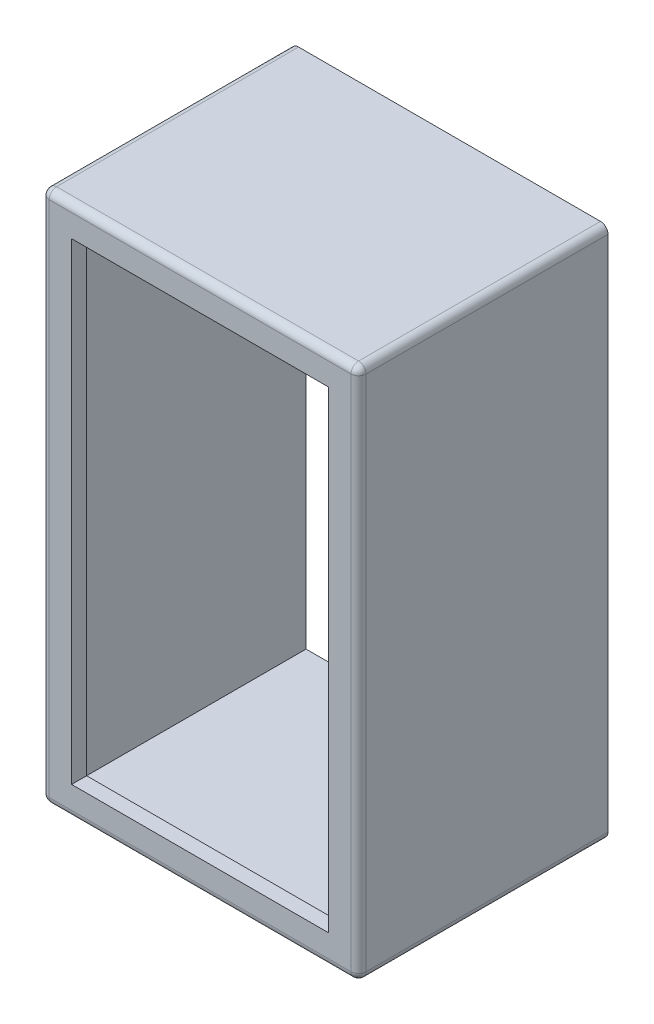
ISO-10303-21;
HEADER;
FILE_DESCRIPTION(('STEP AP214'),'2;1');
FILE_NAME('part.step','',(''),(''),'','','');
FILE_SCHEMA(('AUTOMOTIVE_DESIGN { 1 0 10303 214 1 1 1 1 }'));
ENDSEC;
DATA;
#1=APPLICATION_CONTEXT('core data for automotive mechanical design processes');
#2=APPLICATION_PROTOCOL_DEFINITION('international standard','automotive_design',2000,#1);
#3=PRODUCT_CONTEXT('',#1,'mechanical');
#4=PRODUCT('Part','Part','',(#3));
#5=PRODUCT_RELATED_PRODUCT_CATEGORY('part','',(#4));
#6=PRODUCT_DEFINITION_FORMATION('','',#4);
#7=PRODUCT_DEFINITION_CONTEXT('part definition',#1,'design');
#8=PRODUCT_DEFINITION('design','',#6,#7);
#9=PRODUCT_DEFINITION_SHAPE('','',#8);
#10=(LENGTH_UNIT() NAMED_UNIT(*) SI_UNIT(.MILLI.,.METRE.));
#11=(NAMED_UNIT(*) PLANE_ANGLE_UNIT() SI_UNIT($,.RADIAN.));
#12=(NAMED_UNIT(*) SI_UNIT($,.STERADIAN.) SOLID_ANGLE_UNIT());
#13=UNCERTAINTY_MEASURE_WITH_UNIT(LENGTH_MEASURE(1.E-05),#10,'distance_accuracy_value','');
#14=(GEOMETRIC_REPRESENTATION_CONTEXT(3) GLOBAL_UNCERTAINTY_ASSIGNED_CONTEXT((#13)) GLOBAL_UNIT_ASSIGNED_CONTEXT((#10,
#11,#12)) REPRESENTATION_CONTEXT('',''));
#15=CARTESIAN_POINT('',(0.,0.,0.));
#16=DIRECTION('',(0.,0.,1.));
#17=DIRECTION('',(1.,0.,0.));
#18=AXIS2_PLACEMENT_3D('',#15,#16,#17);
#19=CARTESIAN_POINT('',(9.30389435070419,50.8956969127035,7.93749999999999));
#20=DIRECTION('',(1.,0.,0.));
#21=DIRECTION('',(0.,1.,0.));
#22=AXIS2_PLACEMENT_3D('',#19,#20,#21);
#23=PLANE('',#22);
#24=DIRECTION('',(0.,-1.,0.));
#25=VECTOR('',#24,1.);
#26=CARTESIAN_POINT('',(9.30389435070419,50.8956969127035,8.19149999999999));
#27=LINE('',#26,#25);
#28=CARTESIAN_POINT('',(9.3038943507042,33.1156969127037,8.19149999999999));
#29=VERTEX_POINT('',#28);
#30=CARTESIAN_POINT('',(9.30389435070419,50.6416969127035,8.19149999999999));
#31=VERTEX_POINT('',#30);
#32=EDGE_CURVE('E274',#29,#31,#27,.F.);
#33=ORIENTED_EDGE('',*,*,#32,.T.);
#34=DIRECTION('',(0.,0.,-1.));
#35=VECTOR('',#34,1.);
#36=CARTESIAN_POINT('',(9.30389435070419,50.6416969127035,7.93749999999999));
#37=LINE('',#36,#35);
#38=CARTESIAN_POINT('',(9.30389435070419,50.6416969127035,0.));
#39=VERTEX_POINT('',#38);
#40=EDGE_CURVE('E278',#31,#39,#37,.T.);
#41=ORIENTED_EDGE('',*,*,#40,.T.);
#42=DIRECTION('',(0.,-1.,0.));
#43=VECTOR('',#42,1.);
#44=CARTESIAN_POINT('',(9.30389435070419,50.8956969127035,0.));
#45=LINE('',#44,#43);
#46=CARTESIAN_POINT('',(9.3038943507042,33.1156969127037,0.));
#47=VERTEX_POINT('',#46);
#48=EDGE_CURVE('E232',#39,#47,#45,.T.);
#49=ORIENTED_EDGE('',*,*,#48,.T.);
#50=DIRECTION('',(0.,0.,-1.));
#51=VECTOR('',#50,1.);
#52=CARTESIAN_POINT('',(9.3038943507042,33.1156969127037,7.93749999999999));
#53=LINE('',#52,#51);
#54=EDGE_CURVE('E276',#47,#29,#53,.F.);
#55=ORIENTED_EDGE('',*,*,#54,.T.);
#56=EDGE_LOOP('',(#33,#41,#49,#55));
#57=FACE_BOUND('',#56,.T.);
#58=ADVANCED_FACE('F61',(#57),#23,.F.);
#59=CARTESIAN_POINT('',(9.3038943507042,32.8616969127037,7.93749999999999));
#60=DIRECTION('',(0.,1.,0.));
#61=DIRECTION('',(0.,0.,1.));
#62=AXIS2_PLACEMENT_3D('',#59,#60,#61);
#63=PLANE('',#62);
#64=DIRECTION('',(1.,0.,0.));
#65=VECTOR('',#64,1.);
#66=CARTESIAN_POINT('',(9.3038943507042,32.8616969127037,0.));
#67=LINE('',#66,#65);
#68=CARTESIAN_POINT('',(9.5578943507042,32.8616969127037,0.));
#69=VERTEX_POINT('',#68);
#70=CARTESIAN_POINT('',(19.7813943507042,32.8616969127037,0.));
#71=VERTEX_POINT('',#70);
#72=EDGE_CURVE('E265',#69,#71,#67,.T.);
#73=ORIENTED_EDGE('',*,*,#72,.T.);
#74=DIRECTION('',(0.,0.,-1.));
#75=VECTOR('',#74,1.);
#76=CARTESIAN_POINT('',(19.7813943507042,32.8616969127037,7.93749999999999));
#77=LINE('',#76,#75);
#78=CARTESIAN_POINT('',(19.7813943507042,32.8616969127037,8.19149999999999));
#79=VERTEX_POINT('',#78);
#80=EDGE_CURVE('E305',#71,#79,#77,.F.);
#81=ORIENTED_EDGE('',*,*,#80,.T.);
#82=DIRECTION('',(1.,0.,0.));
#83=VECTOR('',#82,1.);
#84=CARTESIAN_POINT('',(9.3038943507042,32.8616969127037,8.19149999999999));
#85=LINE('',#84,#83);
#86=CARTESIAN_POINT('',(9.5578943507042,32.8616969127037,8.19149999999999));
#87=VERTEX_POINT('',#86);
#88=EDGE_CURVE('E301',#79,#87,#85,.F.);
#89=ORIENTED_EDGE('',*,*,#88,.T.);
#90=DIRECTION('',(0.,0.,-1.));
#91=VECTOR('',#90,1.);
#92=CARTESIAN_POINT('',(9.5578943507042,32.8616969127037,7.93749999999999));
#93=LINE('',#92,#91);
#94=EDGE_CURVE('E303',#87,#69,#93,.T.);
#95=ORIENTED_EDGE('',*,*,#94,.T.);
#96=EDGE_LOOP('',(#73,#81,#89,#95));
#97=FACE_BOUND('',#96,.T.);
#98=ADVANCED_FACE('F397',(#97),#63,.F.);
#99=CARTESIAN_POINT('',(20.0353943507042,50.8956969127035,7.93749999999999));
#100=DIRECTION('',(-1.,0.,0.));
#101=DIRECTION('',(0.,0.,1.));
#102=AXIS2_PLACEMENT_3D('',#99,#100,#101);
#103=PLANE('',#102);
#104=DIRECTION('',(0.,1.,0.));
#105=VECTOR('',#104,1.);
#106=CARTESIAN_POINT('',(20.0353943507042,50.8956969127035,0.));
#107=LINE('',#106,#105);
#108=CARTESIAN_POINT('',(20.0353943507042,33.1156969127037,0.));
#109=VERTEX_POINT('',#108);
#110=CARTESIAN_POINT('',(20.0353943507042,50.6416969127035,0.));
#111=VERTEX_POINT('',#110);
#112=EDGE_CURVE('E268',#109,#111,#107,.T.);
#113=ORIENTED_EDGE('',*,*,#112,.T.);
#114=DIRECTION('',(0.,0.,-1.));
#115=VECTOR('',#114,1.);
#116=CARTESIAN_POINT('',(20.0353943507042,50.6416969127035,7.93749999999999));
#117=LINE('',#116,#115);
#118=CARTESIAN_POINT('',(20.0353943507042,50.6416969127035,8.19149999999999));
#119=VERTEX_POINT('',#118);
#120=EDGE_CURVE('E299',#111,#119,#117,.F.);
#121=ORIENTED_EDGE('',*,*,#120,.T.);
#122=DIRECTION('',(0.,1.,0.));
#123=VECTOR('',#122,1.);
#124=CARTESIAN_POINT('',(20.0353943507042,32.8616969127037,8.19149999999999));
#125=LINE('',#124,#123);
#126=CARTESIAN_POINT('',(20.0353943507042,33.1156969127037,8.19149999999999));
#127=VERTEX_POINT('',#126);
#128=EDGE_CURVE('E295',#119,#127,#125,.F.);
#129=ORIENTED_EDGE('',*,*,#128,.T.);
#130=DIRECTION('',(0.,0.,-1.));
#131=VECTOR('',#130,1.);
#132=CARTESIAN_POINT('',(20.0353943507042,33.1156969127037,7.93749999999999));
#133=LINE('',#132,#131);
#134=EDGE_CURVE('E297',#127,#109,#133,.T.);
#135=ORIENTED_EDGE('',*,*,#134,.T.);
#136=EDGE_LOOP('',(#113,#121,#129,#135));
#137=FACE_BOUND('',#136,.T.);
#138=ADVANCED_FACE('F355',(#137),#103,.F.);
#139=CARTESIAN_POINT('',(9.30389435070419,50.8956969127035,7.93749999999999));
#140=DIRECTION('',(0.,-1.,0.));
#141=DIRECTION('',(0.,0.,-1.));
#142=AXIS2_PLACEMENT_3D('',#139,#140,#141);
#143=PLANE('',#142);
#144=DIRECTION('',(-1.,0.,0.));
#145=VECTOR('',#144,1.);
#146=CARTESIAN_POINT('',(9.30389435070419,50.8956969127035,0.));
#147=LINE('',#146,#145);
#148=CARTESIAN_POINT('',(19.7813943507042,50.8956969127035,0.));
#149=VERTEX_POINT('',#148);
#150=CARTESIAN_POINT('',(9.5578943507042,50.8956969127035,0.));
#151=VERTEX_POINT('',#150);
#152=EDGE_CURVE('E271',#149,#151,#147,.T.);
#153=ORIENTED_EDGE('',*,*,#152,.T.);
#154=DIRECTION('',(0.,0.,-1.));
#155=VECTOR('',#154,1.);
#156=CARTESIAN_POINT('',(9.5578943507042,50.8956969127035,7.93749999999999));
#157=LINE('',#156,#155);
#158=CARTESIAN_POINT('',(9.5578943507042,50.8956969127035,8.19149999999999));
#159=VERTEX_POINT('',#158);
#160=EDGE_CURVE('E293',#151,#159,#157,.F.);
#161=ORIENTED_EDGE('',*,*,#160,.T.);
#162=DIRECTION('',(-1.,0.,0.));
#163=VECTOR('',#162,1.);
#164=CARTESIAN_POINT('',(20.0353943507042,50.8956969127035,8.19149999999999));
#165=LINE('',#164,#163);
#166=CARTESIAN_POINT('',(19.7813943507042,50.8956969127035,8.19149999999999));
#167=VERTEX_POINT('',#166);
#168=EDGE_CURVE('E289',#159,#167,#165,.F.);
#169=ORIENTED_EDGE('',*,*,#168,.T.);
#170=DIRECTION('',(0.,0.,-1.));
#171=VECTOR('',#170,1.);
#172=CARTESIAN_POINT('',(19.7813943507042,50.8956969127035,7.93749999999999));
#173=LINE('',#172,#171);
#174=EDGE_CURVE('E291',#167,#149,#173,.T.);
#175=ORIENTED_EDGE('',*,*,#174,.T.);
#176=EDGE_LOOP('',(#153,#161,#169,#175));
#177=FACE_BOUND('',#176,.T.);
#178=ADVANCED_FACE('F401',(#177),#143,.F.);
#179=CARTESIAN_POINT('',(0.,0.,0.));
#180=DIRECTION('',(0.,0.,1.));
#181=DIRECTION('',(1.,0.,0.));
#182=AXIS2_PLACEMENT_3D('',#179,#180,#181);
#183=PLANE('',#182);
#184=DIRECTION('',(-1.,0.,0.));
#185=VECTOR('',#184,1.);
#186=CARTESIAN_POINT('',(9.30389435070419,50.3876969127035,0.));
#187=LINE('',#186,#185);
#188=CARTESIAN_POINT('',(19.5273943507042,50.3876969127035,0.));
#189=VERTEX_POINT('',#188);
#190=CARTESIAN_POINT('',(9.81189435070419,50.3876969127035,0.));
#191=VERTEX_POINT('',#190);
#192=EDGE_CURVE('E244',#189,#191,#187,.T.);
#193=ORIENTED_EDGE('',*,*,#192,.T.);
#194=DIRECTION('',(0.,-1.,0.));
#195=VECTOR('',#194,1.);
#196=CARTESIAN_POINT('',(9.81189435070419,50.8956969127035,0.));
#197=LINE('',#196,#195);
#198=CARTESIAN_POINT('',(9.8118943507042,33.3696969127037,0.));
#199=VERTEX_POINT('',#198);
#200=EDGE_CURVE('E205',#191,#199,#197,.T.);
#201=ORIENTED_EDGE('',*,*,#200,.T.);
#202=DIRECTION('',(1.,0.,0.));
#203=VECTOR('',#202,1.);
#204=CARTESIAN_POINT('',(9.3038943507042,33.3696969127037,0.));
#205=LINE('',#204,#203);
#206=CARTESIAN_POINT('',(19.5273943507042,33.3696969127037,0.));
#207=VERTEX_POINT('',#206);
#208=EDGE_CURVE('E243',#199,#207,#205,.T.);
#209=ORIENTED_EDGE('',*,*,#208,.T.);
#210=DIRECTION('',(0.,1.,0.));
#211=VECTOR('',#210,1.);
#212=CARTESIAN_POINT('',(19.5273943507042,50.8956969127035,0.));
#213=LINE('',#212,#211);
#214=EDGE_CURVE('E248',#207,#189,#213,.T.);
#215=ORIENTED_EDGE('',*,*,#214,.T.);
#216=EDGE_LOOP('',(#193,#201,#209,#215));
#217=FACE_BOUND('',#216,.T.);
#218=ORIENTED_EDGE('',*,*,#48,.F.);
#219=CARTESIAN_POINT('',(9.5578943507042,50.6416969127035,0.));
#220=DIRECTION('',(0.,0.,1.));
#221=DIRECTION('',(1.,0.,0.));
#222=AXIS2_PLACEMENT_3D('',#219,#220,#221);
#223=CIRCLE('',#222,0.254);
#224=EDGE_CURVE('E287',#39,#151,#223,.F.);
#225=ORIENTED_EDGE('',*,*,#224,.T.);
#226=ORIENTED_EDGE('',*,*,#152,.F.);
#227=CARTESIAN_POINT('',(19.7813943507042,50.6416969127035,0.));
#228=DIRECTION('',(0.,0.,1.));
#229=DIRECTION('',(1.,0.,0.));
#230=AXIS2_PLACEMENT_3D('',#227,#228,#229);
#231=CIRCLE('',#230,0.254);
#232=EDGE_CURVE('E285',#149,#111,#231,.F.);
#233=ORIENTED_EDGE('',*,*,#232,.T.);
#234=ORIENTED_EDGE('',*,*,#112,.F.);
#235=CARTESIAN_POINT('',(19.7813943507042,33.1156969127037,0.));
#236=DIRECTION('',(0.,0.,1.));
#237=DIRECTION('',(1.,0.,0.));
#238=AXIS2_PLACEMENT_3D('',#235,#236,#237);
#239=CIRCLE('',#238,0.254);
#240=EDGE_CURVE('E283',#109,#71,#239,.F.);
#241=ORIENTED_EDGE('',*,*,#240,.T.);
#242=ORIENTED_EDGE('',*,*,#72,.F.);
#243=CARTESIAN_POINT('',(9.5578943507042,33.1156969127037,0.));
#244=DIRECTION('',(0.,0.,1.));
#245=DIRECTION('',(1.,0.,0.));
#246=AXIS2_PLACEMENT_3D('',#243,#244,#245);
#247=CIRCLE('',#246,0.254);
#248=EDGE_CURVE('E281',#69,#47,#247,.F.);
#249=ORIENTED_EDGE('',*,*,#248,.T.);
#250=EDGE_LOOP('',(#218,#225,#226,#233,#234,#241,#242,#249));
#251=FACE_BOUND('',#250,.T.);
#252=ADVANCED_FACE('F359',(#217,#251),#183,.F.);
#253=CARTESIAN_POINT('',(9.81189435070419,50.8956969127035,7.93749999999999));
#254=DIRECTION('',(1.,0.,0.));
#255=DIRECTION('',(0.,1.,0.));
#256=AXIS2_PLACEMENT_3D('',#253,#254,#255);
#257=PLANE('',#256);
#258=ORIENTED_EDGE('',*,*,#200,.F.);
#259=DIRECTION('',(0.,0.,-1.));
#260=VECTOR('',#259,1.);
#261=CARTESIAN_POINT('',(9.81189435070419,50.3876969127035,7.93749999999999));
#262=LINE('',#261,#260);
#263=CARTESIAN_POINT('',(9.81189435070419,50.3876969127035,7.93749999999999));
#264=VERTEX_POINT('',#263);
#265=EDGE_CURVE('E234',#264,#191,#262,.T.);
#266=ORIENTED_EDGE('',*,*,#265,.F.);
#267=DIRECTION('',(0.,-1.,0.));
#268=VECTOR('',#267,1.);
#269=CARTESIAN_POINT('',(9.81189435070419,50.8956969127035,7.93749999999999));
#270=LINE('',#269,#268);
#271=CARTESIAN_POINT('',(9.8118943507042,33.3696969127037,7.93749999999999));
#272=VERTEX_POINT('',#271);
#273=EDGE_CURVE('E247',#264,#272,#270,.T.);
#274=ORIENTED_EDGE('',*,*,#273,.T.);
#275=DIRECTION('',(0.,0.,-1.));
#276=VECTOR('',#275,1.);
#277=CARTESIAN_POINT('',(9.8118943507042,33.3696969127037,7.93749999999999));
#278=LINE('',#277,#276);
#279=EDGE_CURVE('E229',#272,#199,#278,.T.);
#280=ORIENTED_EDGE('',*,*,#279,.T.);
#281=EDGE_LOOP('',(#258,#266,#274,#280));
#282=FACE_BOUND('',#281,.T.);
#283=ADVANCED_FACE('F426',(#282),#257,.T.);
#284=CARTESIAN_POINT('',(9.3038943507042,33.3696969127037,7.93749999999999));
#285=DIRECTION('',(0.,1.,0.));
#286=DIRECTION('',(0.,0.,1.));
#287=AXIS2_PLACEMENT_3D('',#284,#285,#286);
#288=PLANE('',#287);
#289=ORIENTED_EDGE('',*,*,#208,.F.);
#290=ORIENTED_EDGE('',*,*,#279,.F.);
#291=DIRECTION('',(1.,0.,0.));
#292=VECTOR('',#291,1.);
#293=CARTESIAN_POINT('',(9.3038943507042,33.3696969127037,7.93749999999999));
#294=LINE('',#293,#292);
#295=CARTESIAN_POINT('',(19.5273943507042,33.3696969127037,7.93749999999999));
#296=VERTEX_POINT('',#295);
#297=EDGE_CURVE('E255',#272,#296,#294,.T.);
#298=ORIENTED_EDGE('',*,*,#297,.T.);
#299=DIRECTION('',(0.,0.,-1.));
#300=VECTOR('',#299,1.);
#301=CARTESIAN_POINT('',(19.5273943507042,33.3696969127037,7.93749999999999));
#302=LINE('',#301,#300);
#303=EDGE_CURVE('E233',#296,#207,#302,.T.);
#304=ORIENTED_EDGE('',*,*,#303,.T.);
#305=EDGE_LOOP('',(#289,#290,#298,#304));
#306=FACE_BOUND('',#305,.T.);
#307=ADVANCED_FACE('F435',(#306),#288,.T.);
#308=CARTESIAN_POINT('',(19.5273943507042,50.8956969127035,7.93749999999999));
#309=DIRECTION('',(-1.,0.,0.));
#310=DIRECTION('',(0.,0.,1.));
#311=AXIS2_PLACEMENT_3D('',#308,#309,#310);
#312=PLANE('',#311);
#313=ORIENTED_EDGE('',*,*,#214,.F.);
#314=ORIENTED_EDGE('',*,*,#303,.F.);
#315=DIRECTION('',(0.,1.,0.));
#316=VECTOR('',#315,1.);
#317=CARTESIAN_POINT('',(19.5273943507042,50.8956969127035,7.93749999999999));
#318=LINE('',#317,#316);
#319=CARTESIAN_POINT('',(19.5273943507042,50.3876969127035,7.93749999999999));
#320=VERTEX_POINT('',#319);
#321=EDGE_CURVE('E258',#296,#320,#318,.T.);
#322=ORIENTED_EDGE('',*,*,#321,.T.);
#323=DIRECTION('',(0.,0.,-1.));
#324=VECTOR('',#323,1.);
#325=CARTESIAN_POINT('',(19.5273943507042,50.3876969127035,7.93749999999999));
#326=LINE('',#325,#324);
#327=EDGE_CURVE('E236',#320,#189,#326,.T.);
#328=ORIENTED_EDGE('',*,*,#327,.T.);
#329=EDGE_LOOP('',(#313,#314,#322,#328));
#330=FACE_BOUND('',#329,.T.);
#331=ADVANCED_FACE('F431',(#330),#312,.T.);
#332=CARTESIAN_POINT('',(9.30389435070419,50.3876969127035,7.93749999999999));
#333=DIRECTION('',(0.,-1.,0.));
#334=DIRECTION('',(0.,0.,-1.));
#335=AXIS2_PLACEMENT_3D('',#332,#333,#334);
#336=PLANE('',#335);
#337=ORIENTED_EDGE('',*,*,#192,.F.);
#338=ORIENTED_EDGE('',*,*,#327,.F.);
#339=DIRECTION('',(-1.,0.,0.));
#340=VECTOR('',#339,1.);
#341=CARTESIAN_POINT('',(9.30389435070419,50.3876969127035,7.93749999999999));
#342=LINE('',#341,#340);
#343=EDGE_CURVE('E237',#320,#264,#342,.T.);
#344=ORIENTED_EDGE('',*,*,#343,.T.);
#345=ORIENTED_EDGE('',*,*,#265,.T.);
#346=EDGE_LOOP('',(#337,#338,#344,#345));
#347=FACE_BOUND('',#346,.T.);
#348=ADVANCED_FACE('F428',(#347),#336,.T.);
#349=CARTESIAN_POINT('',(0.,0.,8.4455));
#350=DIRECTION('',(0.,0.,1.));
#351=DIRECTION('',(1.,0.,0.));
#352=AXIS2_PLACEMENT_3D('',#349,#350,#351);
#353=PLANE('',#352);
#354=DIRECTION('',(0.,1.,0.));
#355=VECTOR('',#354,1.);
#356=CARTESIAN_POINT('',(19.7813943507042,50.8956969127035,8.4455));
#357=LINE('',#356,#355);
#358=CARTESIAN_POINT('',(19.7813943507042,33.1156969127037,8.4455));
#359=VERTEX_POINT('',#358);
#360=CARTESIAN_POINT('',(19.7813943507042,50.6416969127035,8.4455));
#361=VERTEX_POINT('',#360);
#362=EDGE_CURVE('E70',#359,#361,#357,.T.);
#363=ORIENTED_EDGE('',*,*,#362,.T.);
#364=DIRECTION('',(-1.,0.,0.));
#365=VECTOR('',#364,1.);
#366=CARTESIAN_POINT('',(9.30389435070419,50.6416969127035,8.4455));
#367=LINE('',#366,#365);
#368=CARTESIAN_POINT('',(9.5578943507042,50.6416969127035,8.4455));
#369=VERTEX_POINT('',#368);
#370=EDGE_CURVE('E12',#361,#369,#367,.T.);
#371=ORIENTED_EDGE('',*,*,#370,.T.);
#372=DIRECTION('',(0.,-1.,0.));
#373=VECTOR('',#372,1.);
#374=CARTESIAN_POINT('',(9.5578943507042,32.8616969127037,8.4455));
#375=LINE('',#374,#373);
#376=CARTESIAN_POINT('',(9.5578943507042,33.1156969127037,8.4455));
#377=VERTEX_POINT('',#376);
#378=EDGE_CURVE('E307',#369,#377,#375,.T.);
#379=ORIENTED_EDGE('',*,*,#378,.T.);
#380=DIRECTION('',(1.,0.,0.));
#381=VECTOR('',#380,1.);
#382=CARTESIAN_POINT('',(20.0353943507042,33.1156969127037,8.4455));
#383=LINE('',#382,#381);
#384=EDGE_CURVE('E81',#377,#359,#383,.T.);
#385=ORIENTED_EDGE('',*,*,#384,.T.);
#386=EDGE_LOOP('',(#363,#371,#379,#385));
#387=FACE_BOUND('',#386,.T.);
#388=DIRECTION('',(0.,1.,0.));
#389=VECTOR('',#388,1.);
#390=CARTESIAN_POINT('',(19.0193943507042,33.3696969127037,8.4455));
#391=LINE('',#390,#389);
#392=CARTESIAN_POINT('',(19.0193943507042,33.8776969127037,8.4455));
#393=VERTEX_POINT('',#392);
#394=CARTESIAN_POINT('',(19.0193943507042,49.8796969127035,8.4455));
#395=VERTEX_POINT('',#394);
#396=EDGE_CURVE('E197',#393,#395,#391,.T.);
#397=ORIENTED_EDGE('',*,*,#396,.F.);
#398=DIRECTION('',(1.,0.,0.));
#399=VECTOR('',#398,1.);
#400=CARTESIAN_POINT('',(9.8118943507042,33.8776969127037,8.4455));
#401=LINE('',#400,#399);
#402=CARTESIAN_POINT('',(10.3198943507042,33.8776969127037,8.4455));
#403=VERTEX_POINT('',#402);
#404=EDGE_CURVE('E187',#403,#393,#401,.T.);
#405=ORIENTED_EDGE('',*,*,#404,.F.);
#406=DIRECTION('',(0.,-1.,0.));
#407=VECTOR('',#406,1.);
#408=CARTESIAN_POINT('',(10.3198943507042,50.3876969127035,8.4455));
#409=LINE('',#408,#407);
#410=CARTESIAN_POINT('',(10.3198943507042,49.8796969127035,8.4455));
#411=VERTEX_POINT('',#410);
#412=EDGE_CURVE('E213',#411,#403,#409,.T.);
#413=ORIENTED_EDGE('',*,*,#412,.F.);
#414=DIRECTION('',(-1.,0.,0.));
#415=VECTOR('',#414,1.);
#416=CARTESIAN_POINT('',(19.5273943507042,49.8796969127035,8.4455));
#417=LINE('',#416,#415);
#418=EDGE_CURVE('E211',#395,#411,#417,.T.);
#419=ORIENTED_EDGE('',*,*,#418,.F.);
#420=EDGE_LOOP('',(#397,#405,#413,#419));
#421=FACE_BOUND('',#420,.T.);
#422=ADVANCED_FACE('F209',(#387,#421),#353,.T.);
#423=CARTESIAN_POINT('',(0.,0.,7.93749999999999));
#424=DIRECTION('',(0.,0.,1.));
#425=DIRECTION('',(1.,0.,0.));
#426=AXIS2_PLACEMENT_3D('',#423,#424,#425);
#427=PLANE('',#426);
#428=ORIENTED_EDGE('',*,*,#273,.F.);
#429=ORIENTED_EDGE('',*,*,#343,.F.);
#430=ORIENTED_EDGE('',*,*,#321,.F.);
#431=ORIENTED_EDGE('',*,*,#297,.F.);
#432=EDGE_LOOP('',(#428,#429,#430,#431));
#433=FACE_BOUND('',#432,.T.);
#434=DIRECTION('',(1.,0.,0.));
#435=VECTOR('',#434,1.);
#436=CARTESIAN_POINT('',(9.8118943507042,33.8776969127037,7.93749999999999));
#437=LINE('',#436,#435);
#438=CARTESIAN_POINT('',(10.3198943507042,33.8776969127037,7.93749999999999));
#439=VERTEX_POINT('',#438);
#440=CARTESIAN_POINT('',(19.0193943507042,33.8776969127037,7.93749999999999));
#441=VERTEX_POINT('',#440);
#442=EDGE_CURVE('E217',#439,#441,#437,.T.);
#443=ORIENTED_EDGE('',*,*,#442,.T.);
#444=DIRECTION('',(0.,1.,0.));
#445=VECTOR('',#444,1.);
#446=CARTESIAN_POINT('',(19.0193943507042,33.3696969127037,7.93749999999999));
#447=LINE('',#446,#445);
#448=CARTESIAN_POINT('',(19.0193943507042,49.8796969127035,7.93749999999999));
#449=VERTEX_POINT('',#448);
#450=EDGE_CURVE('E204',#441,#449,#447,.T.);
#451=ORIENTED_EDGE('',*,*,#450,.T.);
#452=DIRECTION('',(-1.,0.,0.));
#453=VECTOR('',#452,1.);
#454=CARTESIAN_POINT('',(19.5273943507042,49.8796969127035,7.93749999999999));
#455=LINE('',#454,#453);
#456=CARTESIAN_POINT('',(10.3198943507042,49.8796969127035,7.93749999999999));
#457=VERTEX_POINT('',#456);
#458=EDGE_CURVE('E220',#449,#457,#455,.T.);
#459=ORIENTED_EDGE('',*,*,#458,.T.);
#460=DIRECTION('',(0.,-1.,0.));
#461=VECTOR('',#460,1.);
#462=CARTESIAN_POINT('',(10.3198943507042,50.3876969127035,7.93749999999999));
#463=LINE('',#462,#461);
#464=EDGE_CURVE('E198',#457,#439,#463,.T.);
#465=ORIENTED_EDGE('',*,*,#464,.T.);
#466=EDGE_LOOP('',(#443,#451,#459,#465));
#467=FACE_BOUND('',#466,.T.);
#468=ADVANCED_FACE('F443',(#433,#467),#427,.F.);
#469=CARTESIAN_POINT('',(9.8118943507042,33.8776969127037,8.4455));
#470=DIRECTION('',(0.,1.,0.));
#471=DIRECTION('',(0.,0.,1.));
#472=AXIS2_PLACEMENT_3D('',#469,#470,#471);
#473=PLANE('',#472);
#474=ORIENTED_EDGE('',*,*,#442,.F.);
#475=DIRECTION('',(0.,0.,-1.));
#476=VECTOR('',#475,1.);
#477=CARTESIAN_POINT('',(10.3198943507042,33.8776969127037,8.4455));
#478=LINE('',#477,#476);
#479=EDGE_CURVE('E193',#403,#439,#478,.T.);
#480=ORIENTED_EDGE('',*,*,#479,.F.);
#481=ORIENTED_EDGE('',*,*,#404,.T.);
#482=DIRECTION('',(0.,0.,-1.));
#483=VECTOR('',#482,1.);
#484=CARTESIAN_POINT('',(19.0193943507042,33.8776969127037,8.4455));
#485=LINE('',#484,#483);
#486=EDGE_CURVE('E190',#393,#441,#485,.T.);
#487=ORIENTED_EDGE('',*,*,#486,.T.);
#488=EDGE_LOOP('',(#474,#480,#481,#487));
#489=FACE_BOUND('',#488,.T.);
#490=ADVANCED_FACE('F189',(#489),#473,.T.);
#491=CARTESIAN_POINT('',(19.0193943507042,33.3696969127037,8.4455));
#492=DIRECTION('',(-1.,0.,0.));
#493=DIRECTION('',(0.,0.,1.));
#494=AXIS2_PLACEMENT_3D('',#491,#492,#493);
#495=PLANE('',#494);
#496=ORIENTED_EDGE('',*,*,#450,.F.);
#497=ORIENTED_EDGE('',*,*,#486,.F.);
#498=ORIENTED_EDGE('',*,*,#396,.T.);
#499=DIRECTION('',(0.,0.,-1.));
#500=VECTOR('',#499,1.);
#501=CARTESIAN_POINT('',(19.0193943507042,49.8796969127035,8.4455));
#502=LINE('',#501,#500);
#503=EDGE_CURVE('E206',#395,#449,#502,.T.);
#504=ORIENTED_EDGE('',*,*,#503,.T.);
#505=EDGE_LOOP('',(#496,#497,#498,#504));
#506=FACE_BOUND('',#505,.T.);
#507=ADVANCED_FACE('F201',(#506),#495,.T.);
#508=CARTESIAN_POINT('',(19.5273943507042,49.8796969127035,8.4455));
#509=DIRECTION('',(0.,-1.,0.));
#510=DIRECTION('',(0.,0.,-1.));
#511=AXIS2_PLACEMENT_3D('',#508,#509,#510);
#512=PLANE('',#511);
#513=ORIENTED_EDGE('',*,*,#458,.F.);
#514=ORIENTED_EDGE('',*,*,#503,.F.);
#515=ORIENTED_EDGE('',*,*,#418,.T.);
#516=DIRECTION('',(0.,0.,-1.));
#517=VECTOR('',#516,1.);
#518=CARTESIAN_POINT('',(10.3198943507042,49.8796969127035,8.4455));
#519=LINE('',#518,#517);
#520=EDGE_CURVE('E226',#411,#457,#519,.T.);
#521=ORIENTED_EDGE('',*,*,#520,.T.);
#522=EDGE_LOOP('',(#513,#514,#515,#521));
#523=FACE_BOUND('',#522,.T.);
#524=ADVANCED_FACE('F453',(#523),#512,.T.);
#525=CARTESIAN_POINT('',(10.3198943507042,50.3876969127035,8.4455));
#526=DIRECTION('',(1.,0.,0.));
#527=DIRECTION('',(0.,1.,0.));
#528=AXIS2_PLACEMENT_3D('',#525,#526,#527);
#529=PLANE('',#528);
#530=ORIENTED_EDGE('',*,*,#464,.F.);
#531=ORIENTED_EDGE('',*,*,#520,.F.);
#532=ORIENTED_EDGE('',*,*,#412,.T.);
#533=ORIENTED_EDGE('',*,*,#479,.T.);
#534=EDGE_LOOP('',(#530,#531,#532,#533));
#535=FACE_BOUND('',#534,.T.);
#536=ADVANCED_FACE('F456',(#535),#529,.T.);
#537=CARTESIAN_POINT('',(19.7813943507042,33.1156969127037,7.93749999999999));
#538=DIRECTION('',(0.,0.,-1.));
#539=DIRECTION('',(-1.,0.,0.));
#540=AXIS2_PLACEMENT_3D('',#537,#538,#539);
#541=CYLINDRICAL_SURFACE('',#540,0.254);
#542=CARTESIAN_POINT('',(19.7813943507042,33.1156969127037,8.19149999999999));
#543=DIRECTION('',(0.,0.,1.));
#544=DIRECTION('',(1.,0.,0.));
#545=AXIS2_PLACEMENT_3D('',#542,#543,#544);
#546=CIRCLE('',#545,0.254);
#547=EDGE_CURVE('E65',#79,#127,#546,.T.);
#548=ORIENTED_EDGE('',*,*,#547,.F.);
#549=ORIENTED_EDGE('',*,*,#80,.F.);
#550=ORIENTED_EDGE('',*,*,#240,.F.);
#551=ORIENTED_EDGE('',*,*,#134,.F.);
#552=EDGE_LOOP('',(#548,#549,#550,#551));
#553=FACE_BOUND('',#552,.T.);
#554=ADVANCED_FACE('F63',(#553),#541,.T.);
#555=CARTESIAN_POINT('',(19.7813943507042,33.1156969127037,8.19149999999999));
#556=DIRECTION('',(0.,0.,1.));
#557=DIRECTION('',(1.,0.,0.));
#558=AXIS2_PLACEMENT_3D('',#555,#556,#557);
#559=SPHERICAL_SURFACE('',#558,0.254);
#560=CARTESIAN_POINT('',(19.7813943507042,33.1156969127037,8.19149999999999));
#561=DIRECTION('',(1.,0.,0.));
#562=DIRECTION('',(0.,0.,-1.));
#563=AXIS2_PLACEMENT_3D('',#560,#561,#562);
#564=CIRCLE('',#563,0.254);
#565=EDGE_CURVE('E337',#79,#359,#564,.F.);
#566=ORIENTED_EDGE('',*,*,#565,.F.);
#567=ORIENTED_EDGE('',*,*,#547,.T.);
#568=CARTESIAN_POINT('',(19.7813943507042,33.1156969127037,8.19149999999999));
#569=DIRECTION('',(0.,-1.,0.));
#570=DIRECTION('',(0.,0.,-1.));
#571=AXIS2_PLACEMENT_3D('',#568,#569,#570);
#572=CIRCLE('',#571,0.254);
#573=EDGE_CURVE('E338',#359,#127,#572,.F.);
#574=ORIENTED_EDGE('',*,*,#573,.F.);
#575=EDGE_LOOP('',(#566,#567,#574));
#576=FACE_BOUND('',#575,.T.);
#577=ADVANCED_FACE('F347',(#576),#559,.T.);
#578=CARTESIAN_POINT('',(19.7813943507042,50.6416969127035,7.93749999999999));
#579=DIRECTION('',(0.,0.,-1.));
#580=DIRECTION('',(-1.,0.,0.));
#581=AXIS2_PLACEMENT_3D('',#578,#579,#580);
#582=CYLINDRICAL_SURFACE('',#581,0.254);
#583=ORIENTED_EDGE('',*,*,#232,.F.);
#584=ORIENTED_EDGE('',*,*,#174,.F.);
#585=CARTESIAN_POINT('',(19.7813943507042,50.6416969127035,8.19149999999999));
#586=DIRECTION('',(0.,0.,1.));
#587=DIRECTION('',(1.,0.,0.));
#588=AXIS2_PLACEMENT_3D('',#585,#586,#587);
#589=CIRCLE('',#588,0.254);
#590=EDGE_CURVE('E334',#119,#167,#589,.T.);
#591=ORIENTED_EDGE('',*,*,#590,.F.);
#592=ORIENTED_EDGE('',*,*,#120,.F.);
#593=EDGE_LOOP('',(#583,#584,#591,#592));
#594=FACE_BOUND('',#593,.T.);
#595=ADVANCED_FACE('F365',(#594),#582,.T.);
#596=CARTESIAN_POINT('',(19.7813943507042,0.,8.19149999999999));
#597=DIRECTION('',(0.,-1.,0.));
#598=DIRECTION('',(0.,0.,-1.));
#599=AXIS2_PLACEMENT_3D('',#596,#597,#598);
#600=CYLINDRICAL_SURFACE('',#599,0.254);
#601=ORIENTED_EDGE('',*,*,#573,.T.);
#602=ORIENTED_EDGE('',*,*,#128,.F.);
#603=CARTESIAN_POINT('',(19.7813943507042,50.6416969127035,8.19149999999999));
#604=DIRECTION('',(0.,1.,0.));
#605=DIRECTION('',(0.,0.,1.));
#606=AXIS2_PLACEMENT_3D('',#603,#604,#605);
#607=CIRCLE('',#606,0.254);
#608=EDGE_CURVE('E331',#361,#119,#607,.T.);
#609=ORIENTED_EDGE('',*,*,#608,.F.);
#610=ORIENTED_EDGE('',*,*,#362,.F.);
#611=EDGE_LOOP('',(#601,#602,#609,#610));
#612=FACE_BOUND('',#611,.T.);
#613=ADVANCED_FACE('F367',(#612),#600,.T.);
#614=CARTESIAN_POINT('',(0.,33.1156969127037,8.19149999999999));
#615=DIRECTION('',(-1.,0.,0.));
#616=DIRECTION('',(0.,0.,1.));
#617=AXIS2_PLACEMENT_3D('',#614,#615,#616);
#618=CYLINDRICAL_SURFACE('',#617,0.254);
#619=ORIENTED_EDGE('',*,*,#565,.T.);
#620=ORIENTED_EDGE('',*,*,#384,.F.);
#621=CARTESIAN_POINT('',(9.5578943507042,33.1156969127037,8.19149999999999));
#622=DIRECTION('',(-1.,0.,0.));
#623=DIRECTION('',(0.,0.,1.));
#624=AXIS2_PLACEMENT_3D('',#621,#622,#623);
#625=CIRCLE('',#624,0.254);
#626=EDGE_CURVE('E328',#87,#377,#625,.T.);
#627=ORIENTED_EDGE('',*,*,#626,.F.);
#628=ORIENTED_EDGE('',*,*,#88,.F.);
#629=EDGE_LOOP('',(#619,#620,#627,#628));
#630=FACE_BOUND('',#629,.T.);
#631=ADVANCED_FACE('F381',(#630),#618,.T.);
#632=CARTESIAN_POINT('',(9.5578943507042,33.1156969127037,7.93749999999999));
#633=DIRECTION('',(0.,0.,-1.));
#634=DIRECTION('',(-1.,0.,0.));
#635=AXIS2_PLACEMENT_3D('',#632,#633,#634);
#636=CYLINDRICAL_SURFACE('',#635,0.254);
#637=ORIENTED_EDGE('',*,*,#248,.F.);
#638=ORIENTED_EDGE('',*,*,#94,.F.);
#639=CARTESIAN_POINT('',(9.5578943507042,33.1156969127037,8.19149999999999));
#640=DIRECTION('',(0.,0.,1.));
#641=DIRECTION('',(1.,0.,0.));
#642=AXIS2_PLACEMENT_3D('',#639,#640,#641);
#643=CIRCLE('',#642,0.254);
#644=EDGE_CURVE('E325',#29,#87,#643,.T.);
#645=ORIENTED_EDGE('',*,*,#644,.F.);
#646=ORIENTED_EDGE('',*,*,#54,.F.);
#647=EDGE_LOOP('',(#637,#638,#645,#646));
#648=FACE_BOUND('',#647,.T.);
#649=ADVANCED_FACE('F395',(#648),#636,.T.);
#650=CARTESIAN_POINT('',(19.7813943507042,50.6416969127035,8.19149999999999));
#651=DIRECTION('',(0.,0.,1.));
#652=DIRECTION('',(1.,0.,0.));
#653=AXIS2_PLACEMENT_3D('',#650,#651,#652);
#654=SPHERICAL_SURFACE('',#653,0.254);
#655=ORIENTED_EDGE('',*,*,#608,.T.);
#656=ORIENTED_EDGE('',*,*,#590,.T.);
#657=CARTESIAN_POINT('',(19.7813943507042,50.6416969127035,8.19149999999999));
#658=DIRECTION('',(1.,0.,0.));
#659=DIRECTION('',(0.,0.,-1.));
#660=AXIS2_PLACEMENT_3D('',#657,#658,#659);
#661=CIRCLE('',#660,0.254);
#662=EDGE_CURVE('E322',#361,#167,#661,.F.);
#663=ORIENTED_EDGE('',*,*,#662,.F.);
#664=EDGE_LOOP('',(#655,#656,#663));
#665=FACE_BOUND('',#664,.T.);
#666=ADVANCED_FACE('F371',(#665),#654,.T.);
#667=CARTESIAN_POINT('',(9.5578943507042,33.1156969127037,8.19149999999999));
#668=DIRECTION('',(0.,0.,1.));
#669=DIRECTION('',(1.,0.,0.));
#670=AXIS2_PLACEMENT_3D('',#667,#668,#669);
#671=SPHERICAL_SURFACE('',#670,0.254);
#672=ORIENTED_EDGE('',*,*,#644,.T.);
#673=ORIENTED_EDGE('',*,*,#626,.T.);
#674=CARTESIAN_POINT('',(9.5578943507042,33.1156969127037,8.19149999999999));
#675=DIRECTION('',(0.,-1.,0.));
#676=DIRECTION('',(0.,0.,-1.));
#677=AXIS2_PLACEMENT_3D('',#674,#675,#676);
#678=CIRCLE('',#677,0.254);
#679=EDGE_CURVE('E319',#29,#377,#678,.F.);
#680=ORIENTED_EDGE('',*,*,#679,.F.);
#681=EDGE_LOOP('',(#672,#673,#680));
#682=FACE_BOUND('',#681,.T.);
#683=ADVANCED_FACE('F384',(#682),#671,.T.);
#684=CARTESIAN_POINT('',(0.,50.6416969127035,8.19149999999999));
#685=DIRECTION('',(1.,0.,0.));
#686=DIRECTION('',(0.,0.,-1.));
#687=AXIS2_PLACEMENT_3D('',#684,#685,#686);
#688=CYLINDRICAL_SURFACE('',#687,0.254);
#689=ORIENTED_EDGE('',*,*,#662,.T.);
#690=ORIENTED_EDGE('',*,*,#168,.F.);
#691=CARTESIAN_POINT('',(9.5578943507042,50.6416969127035,8.19149999999999));
#692=DIRECTION('',(-1.,0.,0.));
#693=DIRECTION('',(0.,0.,1.));
#694=AXIS2_PLACEMENT_3D('',#691,#692,#693);
#695=CIRCLE('',#694,0.254);
#696=EDGE_CURVE('E316',#369,#159,#695,.T.);
#697=ORIENTED_EDGE('',*,*,#696,.F.);
#698=ORIENTED_EDGE('',*,*,#370,.F.);
#699=EDGE_LOOP('',(#689,#690,#697,#698));
#700=FACE_BOUND('',#699,.T.);
#701=ADVANCED_FACE('F375',(#700),#688,.T.);
#702=CARTESIAN_POINT('',(9.5578943507042,0.,8.19149999999999));
#703=DIRECTION('',(0.,1.,0.));
#704=DIRECTION('',(-1.,0.,0.));
#705=AXIS2_PLACEMENT_3D('',#702,#703,#704);
#706=CYLINDRICAL_SURFACE('',#705,0.254);
#707=ORIENTED_EDGE('',*,*,#679,.T.);
#708=ORIENTED_EDGE('',*,*,#378,.F.);
#709=CARTESIAN_POINT('',(9.5578943507042,50.6416969127035,8.19149999999999));
#710=DIRECTION('',(0.,1.,0.));
#711=DIRECTION('',(0.,0.,1.));
#712=AXIS2_PLACEMENT_3D('',#709,#710,#711);
#713=CIRCLE('',#712,0.254);
#714=EDGE_CURVE('E314',#31,#369,#713,.T.);
#715=ORIENTED_EDGE('',*,*,#714,.F.);
#716=ORIENTED_EDGE('',*,*,#32,.F.);
#717=EDGE_LOOP('',(#707,#708,#715,#716));
#718=FACE_BOUND('',#717,.T.);
#719=ADVANCED_FACE('F387',(#718),#706,.T.);
#720=CARTESIAN_POINT('',(9.5578943507042,50.6416969127035,8.19149999999999));
#721=DIRECTION('',(0.,0.,1.));
#722=DIRECTION('',(1.,0.,0.));
#723=AXIS2_PLACEMENT_3D('',#720,#721,#722);
#724=SPHERICAL_SURFACE('',#723,0.254);
#725=ORIENTED_EDGE('',*,*,#714,.T.);
#726=ORIENTED_EDGE('',*,*,#696,.T.);
#727=CARTESIAN_POINT('',(9.5578943507042,50.6416969127035,8.19149999999999));
#728=DIRECTION('',(0.,0.,1.));
#729=DIRECTION('',(1.,0.,0.));
#730=AXIS2_PLACEMENT_3D('',#727,#728,#729);
#731=CIRCLE('',#730,0.254);
#732=EDGE_CURVE('E311',#31,#159,#731,.F.);
#733=ORIENTED_EDGE('',*,*,#732,.F.);
#734=EDGE_LOOP('',(#725,#726,#733));
#735=FACE_BOUND('',#734,.T.);
#736=ADVANCED_FACE('F404',(#735),#724,.T.);
#737=CARTESIAN_POINT('',(9.5578943507042,50.6416969127035,7.93749999999999));
#738=DIRECTION('',(0.,0.,-1.));
#739=DIRECTION('',(-1.,0.,0.));
#740=AXIS2_PLACEMENT_3D('',#737,#738,#739);
#741=CYLINDRICAL_SURFACE('',#740,0.254);
#742=ORIENTED_EDGE('',*,*,#732,.T.);
#743=ORIENTED_EDGE('',*,*,#160,.F.);
#744=ORIENTED_EDGE('',*,*,#224,.F.);
#745=ORIENTED_EDGE('',*,*,#40,.F.);
#746=EDGE_LOOP('',(#742,#743,#744,#745));
#747=FACE_BOUND('',#746,.T.);
#748=ADVANCED_FACE('F402',(#747),#741,.T.);
#749=CLOSED_SHELL('',(#58,#98,#138,#178,#252,#283,#307,#331,#348,#422,#468,#490,#507,#524,#536,
#554,#577,#595,#613,#631,#649,#666,#683,#701,#719,#736,#748));
#750=MANIFOLD_SOLID_BREP('B2',#749);
#751=ADVANCED_BREP_SHAPE_REPRESENTATION('',(#18,#750),#14);
#752=SHAPE_DEFINITION_REPRESENTATION(#9,#751);
ENDSEC;
END-ISO-10303-21;
